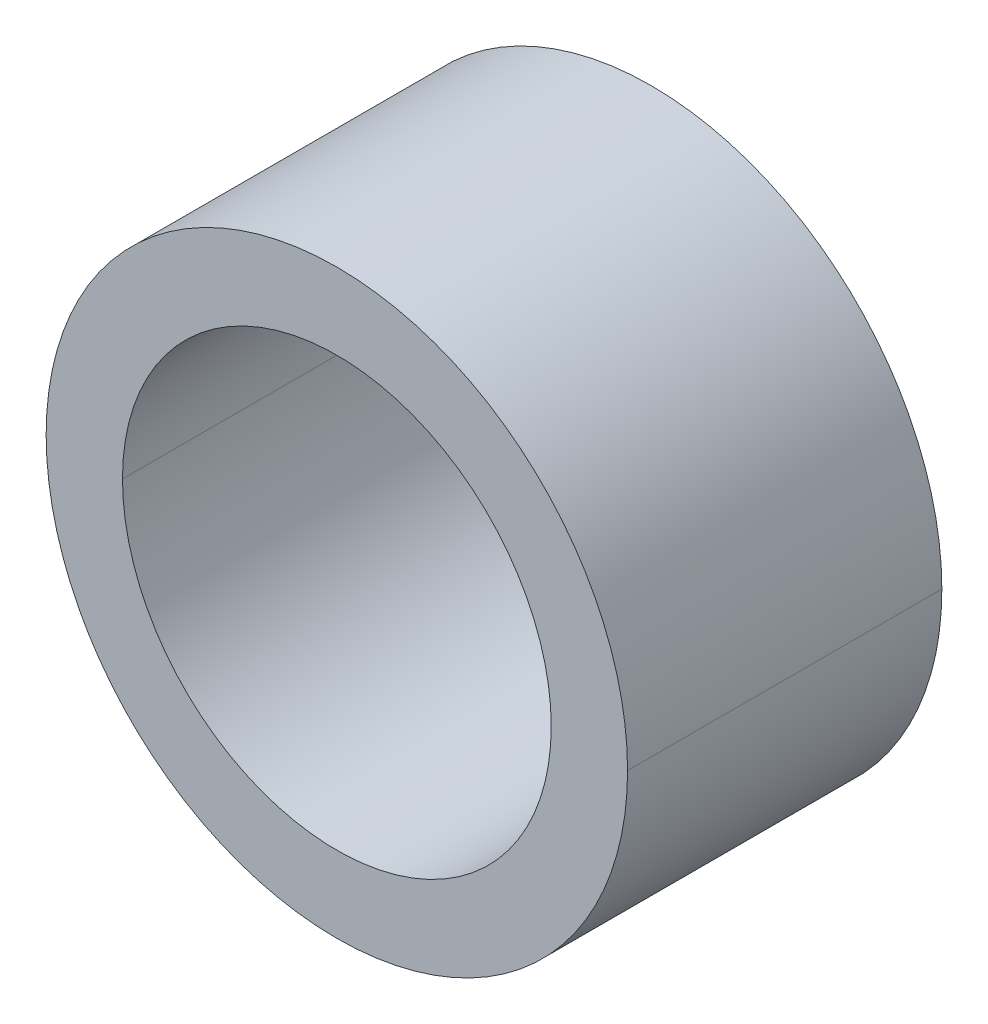
ISO-10303-21;
HEADER;
FILE_DESCRIPTION(('STEP AP214'),'2;1');
FILE_NAME('part.step','',(''),(''),'','','');
FILE_SCHEMA(('AUTOMOTIVE_DESIGN { 1 0 10303 214 1 1 1 1 }'));
ENDSEC;
DATA;
#1=APPLICATION_CONTEXT('core data for automotive mechanical design processes');
#2=APPLICATION_PROTOCOL_DEFINITION('international standard','automotive_design',2000,#1);
#3=PRODUCT_CONTEXT('',#1,'mechanical');
#4=PRODUCT('Part','Part','',(#3));
#5=PRODUCT_RELATED_PRODUCT_CATEGORY('part','',(#4));
#6=PRODUCT_DEFINITION_FORMATION('','',#4);
#7=PRODUCT_DEFINITION_CONTEXT('part definition',#1,'design');
#8=PRODUCT_DEFINITION('design','',#6,#7);
#9=PRODUCT_DEFINITION_SHAPE('','',#8);
#10=(LENGTH_UNIT() NAMED_UNIT(*) SI_UNIT(.MILLI.,.METRE.));
#11=(NAMED_UNIT(*) PLANE_ANGLE_UNIT() SI_UNIT($,.RADIAN.));
#12=(NAMED_UNIT(*) SI_UNIT($,.STERADIAN.) SOLID_ANGLE_UNIT());
#13=UNCERTAINTY_MEASURE_WITH_UNIT(LENGTH_MEASURE(1.E-05),#10,'distance_accuracy_value','');
#14=(GEOMETRIC_REPRESENTATION_CONTEXT(3) GLOBAL_UNCERTAINTY_ASSIGNED_CONTEXT((#13)) GLOBAL_UNIT_ASSIGNED_CONTEXT((#10,
#11,#12)) REPRESENTATION_CONTEXT('',''));
#15=CARTESIAN_POINT('',(0.,0.,0.));
#16=DIRECTION('',(0.,0.,1.));
#17=DIRECTION('',(1.,0.,0.));
#18=AXIS2_PLACEMENT_3D('',#15,#16,#17);
#19=CARTESIAN_POINT('',(0.,0.,7.112));
#20=DIRECTION('',(0.,0.,-1.));
#21=DIRECTION('',(-1.,0.,0.));
#22=AXIS2_PLACEMENT_3D('',#19,#20,#21);
#23=CYLINDRICAL_SURFACE('',#22,4.8514);
#24=DIRECTION('',(0.,0.,-1.));
#25=VECTOR('',#24,1.);
#26=CARTESIAN_POINT('',(4.8514,0.,7.112));
#27=LINE('',#26,#25);
#28=CARTESIAN_POINT('',(4.8514,0.,7.112));
#29=VERTEX_POINT('',#28);
#30=CARTESIAN_POINT('',(4.8514,0.,0.));
#31=VERTEX_POINT('',#30);
#32=EDGE_CURVE('E77',#29,#31,#27,.T.);
#33=ORIENTED_EDGE('',*,*,#32,.F.);
#34=CARTESIAN_POINT('',(0.,0.,7.112));
#35=DIRECTION('',(0.,0.,1.));
#36=DIRECTION('',(1.,0.,0.));
#37=AXIS2_PLACEMENT_3D('',#34,#35,#36);
#38=CIRCLE('',#37,4.8514);
#39=CARTESIAN_POINT('',(-4.8514,0.,7.112));
#40=VERTEX_POINT('',#39);
#41=EDGE_CURVE('E72',#29,#40,#38,.T.);
#42=ORIENTED_EDGE('',*,*,#41,.T.);
#43=DIRECTION('',(0.,0.,-1.));
#44=VECTOR('',#43,1.);
#45=CARTESIAN_POINT('',(-4.8514,0.,7.112));
#46=LINE('',#45,#44);
#47=CARTESIAN_POINT('',(-4.8514,0.,0.));
#48=VERTEX_POINT('',#47);
#49=EDGE_CURVE('E74',#40,#48,#46,.T.);
#50=ORIENTED_EDGE('',*,*,#49,.T.);
#51=CARTESIAN_POINT('',(0.,0.,0.));
#52=DIRECTION('',(0.,0.,1.));
#53=DIRECTION('',(1.,0.,0.));
#54=AXIS2_PLACEMENT_3D('',#51,#52,#53);
#55=CIRCLE('',#54,4.8514);
#56=EDGE_CURVE('E11',#31,#48,#55,.T.);
#57=ORIENTED_EDGE('',*,*,#56,.F.);
#58=EDGE_LOOP('',(#33,#42,#50,#57));
#59=FACE_BOUND('',#58,.T.);
#60=ADVANCED_FACE('F16',(#59),#23,.F.);
#61=CARTESIAN_POINT('',(0.,0.,7.112));
#62=DIRECTION('',(0.,0.,-1.));
#63=DIRECTION('',(-1.,0.,0.));
#64=AXIS2_PLACEMENT_3D('',#61,#62,#63);
#65=CYLINDRICAL_SURFACE('',#64,6.5786);
#66=DIRECTION('',(0.,0.,-1.));
#67=VECTOR('',#66,1.);
#68=CARTESIAN_POINT('',(6.5786,0.,7.112));
#69=LINE('',#68,#67);
#70=CARTESIAN_POINT('',(6.5786,0.,7.112));
#71=VERTEX_POINT('',#70);
#72=CARTESIAN_POINT('',(6.5786,0.,0.));
#73=VERTEX_POINT('',#72);
#74=EDGE_CURVE('E103',#71,#73,#69,.T.);
#75=ORIENTED_EDGE('',*,*,#74,.F.);
#76=CARTESIAN_POINT('',(0.,0.,7.112));
#77=DIRECTION('',(0.,0.,1.));
#78=DIRECTION('',(1.,0.,0.));
#79=AXIS2_PLACEMENT_3D('',#76,#77,#78);
#80=CIRCLE('',#79,6.5786);
#81=CARTESIAN_POINT('',(-6.5786,0.,7.112));
#82=VERTEX_POINT('',#81);
#83=EDGE_CURVE('E19',#82,#71,#80,.T.);
#84=ORIENTED_EDGE('',*,*,#83,.F.);
#85=DIRECTION('',(0.,0.,-1.));
#86=VECTOR('',#85,1.);
#87=CARTESIAN_POINT('',(-6.5786,0.,7.112));
#88=LINE('',#87,#86);
#89=CARTESIAN_POINT('',(-6.5786,0.,0.));
#90=VERTEX_POINT('',#89);
#91=EDGE_CURVE('E115',#82,#90,#88,.T.);
#92=ORIENTED_EDGE('',*,*,#91,.T.);
#93=CARTESIAN_POINT('',(0.,0.,0.));
#94=DIRECTION('',(0.,0.,1.));
#95=DIRECTION('',(1.,0.,0.));
#96=AXIS2_PLACEMENT_3D('',#93,#94,#95);
#97=CIRCLE('',#96,6.5786);
#98=EDGE_CURVE('E25',#90,#73,#97,.T.);
#99=ORIENTED_EDGE('',*,*,#98,.T.);
#100=EDGE_LOOP('',(#75,#84,#92,#99));
#101=FACE_BOUND('',#100,.T.);
#102=ADVANCED_FACE('F124',(#101),#65,.T.);
#103=CARTESIAN_POINT('',(0.,0.,0.));
#104=DIRECTION('',(0.,0.,1.));
#105=DIRECTION('',(1.,0.,0.));
#106=AXIS2_PLACEMENT_3D('',#103,#104,#105);
#107=PLANE('',#106);
#108=CARTESIAN_POINT('',(0.,0.,0.));
#109=DIRECTION('',(0.,0.,1.));
#110=DIRECTION('',(1.,0.,0.));
#111=AXIS2_PLACEMENT_3D('',#108,#109,#110);
#112=CIRCLE('',#111,4.8514);
#113=EDGE_CURVE('E87',#48,#31,#112,.T.);
#114=ORIENTED_EDGE('',*,*,#113,.T.);
#115=ORIENTED_EDGE('',*,*,#56,.T.);
#116=EDGE_LOOP('',(#114,#115));
#117=FACE_BOUND('',#116,.T.);
#118=ORIENTED_EDGE('',*,*,#98,.F.);
#119=CARTESIAN_POINT('',(0.,0.,0.));
#120=DIRECTION('',(0.,0.,1.));
#121=DIRECTION('',(1.,0.,0.));
#122=AXIS2_PLACEMENT_3D('',#119,#120,#121);
#123=CIRCLE('',#122,6.5786);
#124=EDGE_CURVE('E107',#73,#90,#123,.T.);
#125=ORIENTED_EDGE('',*,*,#124,.F.);
#126=EDGE_LOOP('',(#118,#125));
#127=FACE_BOUND('',#126,.T.);
#128=ADVANCED_FACE('F127',(#117,#127),#107,.F.);
#129=CARTESIAN_POINT('',(0.,0.,7.112));
#130=DIRECTION('',(0.,0.,1.));
#131=DIRECTION('',(1.,0.,0.));
#132=AXIS2_PLACEMENT_3D('',#129,#130,#131);
#133=PLANE('',#132);
#134=CARTESIAN_POINT('',(0.,0.,7.112));
#135=DIRECTION('',(0.,0.,1.));
#136=DIRECTION('',(1.,0.,0.));
#137=AXIS2_PLACEMENT_3D('',#134,#135,#136);
#138=CIRCLE('',#137,4.8514);
#139=EDGE_CURVE('E85',#40,#29,#138,.T.);
#140=ORIENTED_EDGE('',*,*,#139,.F.);
#141=ORIENTED_EDGE('',*,*,#41,.F.);
#142=EDGE_LOOP('',(#140,#141));
#143=FACE_BOUND('',#142,.T.);
#144=ORIENTED_EDGE('',*,*,#83,.T.);
#145=CARTESIAN_POINT('',(0.,0.,7.112));
#146=DIRECTION('',(0.,0.,1.));
#147=DIRECTION('',(1.,0.,0.));
#148=AXIS2_PLACEMENT_3D('',#145,#146,#147);
#149=CIRCLE('',#148,6.5786);
#150=EDGE_CURVE('E89',#71,#82,#149,.T.);
#151=ORIENTED_EDGE('',*,*,#150,.T.);
#152=EDGE_LOOP('',(#144,#151));
#153=FACE_BOUND('',#152,.T.);
#154=ADVANCED_FACE('F91',(#143,#153),#133,.T.);
#155=CARTESIAN_POINT('',(0.,0.,7.112));
#156=DIRECTION('',(0.,0.,-1.));
#157=DIRECTION('',(-1.,0.,0.));
#158=AXIS2_PLACEMENT_3D('',#155,#156,#157);
#159=CYLINDRICAL_SURFACE('',#158,6.5786);
#160=ORIENTED_EDGE('',*,*,#150,.F.);
#161=ORIENTED_EDGE('',*,*,#74,.T.);
#162=ORIENTED_EDGE('',*,*,#124,.T.);
#163=ORIENTED_EDGE('',*,*,#91,.F.);
#164=EDGE_LOOP('',(#160,#161,#162,#163));
#165=FACE_BOUND('',#164,.T.);
#166=ADVANCED_FACE('F126',(#165),#159,.T.);
#167=CARTESIAN_POINT('',(0.,0.,7.112));
#168=DIRECTION('',(0.,0.,-1.));
#169=DIRECTION('',(-1.,0.,0.));
#170=AXIS2_PLACEMENT_3D('',#167,#168,#169);
#171=CYLINDRICAL_SURFACE('',#170,4.8514);
#172=ORIENTED_EDGE('',*,*,#139,.T.);
#173=ORIENTED_EDGE('',*,*,#32,.T.);
#174=ORIENTED_EDGE('',*,*,#113,.F.);
#175=ORIENTED_EDGE('',*,*,#49,.F.);
#176=EDGE_LOOP('',(#172,#173,#174,#175));
#177=FACE_BOUND('',#176,.T.);
#178=ADVANCED_FACE('F84',(#177),#171,.F.);
#179=CLOSED_SHELL('',(#60,#102,#128,#154,#166,#178));
#180=MANIFOLD_SOLID_BREP('B1',#179);
#181=ADVANCED_BREP_SHAPE_REPRESENTATION('',(#18,#180),#14);
#182=SHAPE_DEFINITION_REPRESENTATION(#9,#181);
ENDSEC;
END-ISO-10303-21;
